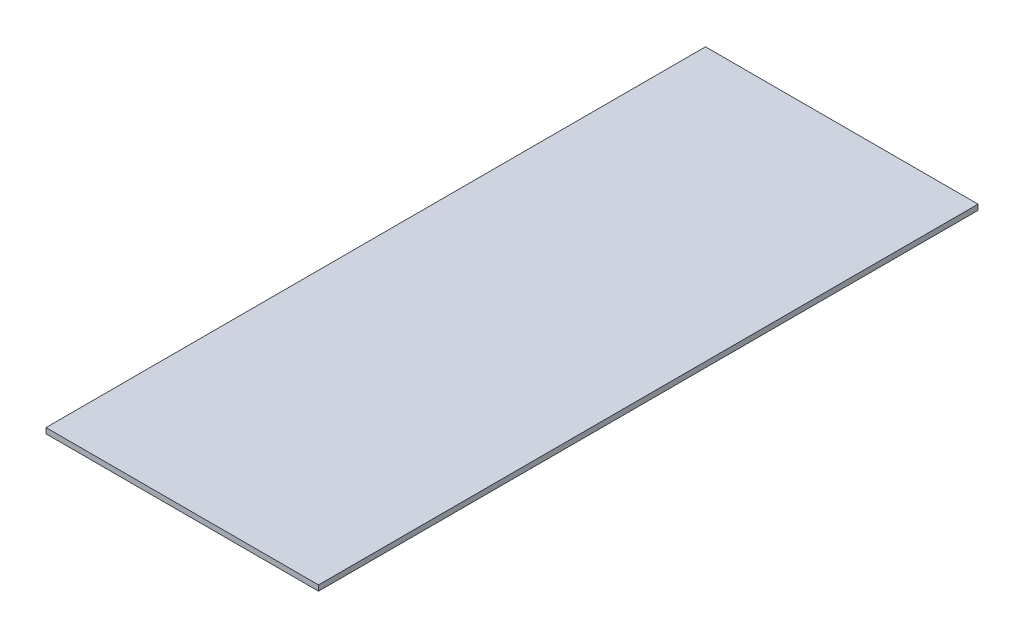
ISO-10303-21;
HEADER;
FILE_DESCRIPTION(('STEP AP214'),'2;1');
FILE_NAME('part.step','',(''),(''),'','','');
FILE_SCHEMA(('AUTOMOTIVE_DESIGN { 1 0 10303 214 1 1 1 1 }'));
ENDSEC;
DATA;
#1=APPLICATION_CONTEXT('core data for automotive mechanical design processes');
#2=APPLICATION_PROTOCOL_DEFINITION('international standard','automotive_design',2000,#1);
#3=PRODUCT_CONTEXT('',#1,'mechanical');
#4=PRODUCT('Part','Part','',(#3));
#5=PRODUCT_RELATED_PRODUCT_CATEGORY('part','',(#4));
#6=PRODUCT_DEFINITION_FORMATION('','',#4);
#7=PRODUCT_DEFINITION_CONTEXT('part definition',#1,'design');
#8=PRODUCT_DEFINITION('design','',#6,#7);
#9=PRODUCT_DEFINITION_SHAPE('','',#8);
#10=(LENGTH_UNIT() NAMED_UNIT(*) SI_UNIT(.MILLI.,.METRE.));
#11=(NAMED_UNIT(*) PLANE_ANGLE_UNIT() SI_UNIT($,.RADIAN.));
#12=(NAMED_UNIT(*) SI_UNIT($,.STERADIAN.) SOLID_ANGLE_UNIT());
#13=UNCERTAINTY_MEASURE_WITH_UNIT(LENGTH_MEASURE(1.E-05),#10,'distance_accuracy_value','');
#14=(GEOMETRIC_REPRESENTATION_CONTEXT(3) GLOBAL_UNCERTAINTY_ASSIGNED_CONTEXT((#13)) GLOBAL_UNIT_ASSIGNED_CONTEXT((#10,
#11,#12)) REPRESENTATION_CONTEXT('',''));
#15=CARTESIAN_POINT('',(0.,0.,0.));
#16=DIRECTION('',(0.,0.,1.));
#17=DIRECTION('',(1.,0.,0.));
#18=AXIS2_PLACEMENT_3D('',#15,#16,#17);
#19=CARTESIAN_POINT('',(-50.,2.,121.));
#20=DIRECTION('',(1.,0.,0.));
#21=DIRECTION('',(0.,0.,-1.));
#22=AXIS2_PLACEMENT_3D('',#19,#20,#21);
#23=PLANE('',#22);
#24=DIRECTION('',(0.,0.,1.));
#25=VECTOR('',#24,1.);
#26=CARTESIAN_POINT('',(-50.,0.,121.));
#27=LINE('',#26,#25);
#28=CARTESIAN_POINT('',(-50.,0.,-121.));
#29=VERTEX_POINT('',#28);
#30=CARTESIAN_POINT('',(-50.,0.,121.));
#31=VERTEX_POINT('',#30);
#32=EDGE_CURVE('E92',#29,#31,#27,.T.);
#33=ORIENTED_EDGE('',*,*,#32,.T.);
#34=DIRECTION('',(0.,-1.,0.));
#35=VECTOR('',#34,1.);
#36=CARTESIAN_POINT('',(-50.,2.,121.));
#37=LINE('',#36,#35);
#38=CARTESIAN_POINT('',(-50.,2.,121.));
#39=VERTEX_POINT('',#38);
#40=EDGE_CURVE('E46',#39,#31,#37,.T.);
#41=ORIENTED_EDGE('',*,*,#40,.F.);
#42=DIRECTION('',(0.,0.,1.));
#43=VECTOR('',#42,1.);
#44=CARTESIAN_POINT('',(-50.,2.,121.));
#45=LINE('',#44,#43);
#46=CARTESIAN_POINT('',(-50.,2.,-121.));
#47=VERTEX_POINT('',#46);
#48=EDGE_CURVE('E85',#47,#39,#45,.T.);
#49=ORIENTED_EDGE('',*,*,#48,.F.);
#50=DIRECTION('',(0.,-1.,0.));
#51=VECTOR('',#50,1.);
#52=CARTESIAN_POINT('',(-50.,2.,-121.));
#53=LINE('',#52,#51);
#54=EDGE_CURVE('E11',#47,#29,#53,.T.);
#55=ORIENTED_EDGE('',*,*,#54,.T.);
#56=EDGE_LOOP('',(#33,#41,#49,#55));
#57=FACE_BOUND('',#56,.T.);
#58=ADVANCED_FACE('F38',(#57),#23,.F.);
#59=CARTESIAN_POINT('',(50.,2.,121.));
#60=DIRECTION('',(0.,0.,-1.));
#61=DIRECTION('',(-1.,0.,0.));
#62=AXIS2_PLACEMENT_3D('',#59,#60,#61);
#63=PLANE('',#62);
#64=DIRECTION('',(1.,0.,0.));
#65=VECTOR('',#64,1.);
#66=CARTESIAN_POINT('',(50.,0.,121.));
#67=LINE('',#66,#65);
#68=CARTESIAN_POINT('',(50.,0.,121.));
#69=VERTEX_POINT('',#68);
#70=EDGE_CURVE('E72',#31,#69,#67,.T.);
#71=ORIENTED_EDGE('',*,*,#70,.T.);
#72=DIRECTION('',(0.,-1.,0.));
#73=VECTOR('',#72,1.);
#74=CARTESIAN_POINT('',(50.,2.,121.));
#75=LINE('',#74,#73);
#76=CARTESIAN_POINT('',(50.,2.,121.));
#77=VERTEX_POINT('',#76);
#78=EDGE_CURVE('E93',#77,#69,#75,.T.);
#79=ORIENTED_EDGE('',*,*,#78,.F.);
#80=DIRECTION('',(1.,0.,0.));
#81=VECTOR('',#80,1.);
#82=CARTESIAN_POINT('',(50.,2.,121.));
#83=LINE('',#82,#81);
#84=EDGE_CURVE('E89',#39,#77,#83,.T.);
#85=ORIENTED_EDGE('',*,*,#84,.F.);
#86=ORIENTED_EDGE('',*,*,#40,.T.);
#87=EDGE_LOOP('',(#71,#79,#85,#86));
#88=FACE_BOUND('',#87,.T.);
#89=ADVANCED_FACE('F94',(#88),#63,.F.);
#90=CARTESIAN_POINT('',(50.,2.,-121.));
#91=DIRECTION('',(-1.,0.,0.));
#92=DIRECTION('',(0.,0.,1.));
#93=AXIS2_PLACEMENT_3D('',#90,#91,#92);
#94=PLANE('',#93);
#95=DIRECTION('',(0.,0.,-1.));
#96=VECTOR('',#95,1.);
#97=CARTESIAN_POINT('',(50.,0.,-121.));
#98=LINE('',#97,#96);
#99=CARTESIAN_POINT('',(50.,0.,-121.));
#100=VERTEX_POINT('',#99);
#101=EDGE_CURVE('E79',#69,#100,#98,.T.);
#102=ORIENTED_EDGE('',*,*,#101,.T.);
#103=DIRECTION('',(0.,-1.,0.));
#104=VECTOR('',#103,1.);
#105=CARTESIAN_POINT('',(50.,2.,-121.));
#106=LINE('',#105,#104);
#107=CARTESIAN_POINT('',(50.,2.,-121.));
#108=VERTEX_POINT('',#107);
#109=EDGE_CURVE('E98',#108,#100,#106,.T.);
#110=ORIENTED_EDGE('',*,*,#109,.F.);
#111=DIRECTION('',(0.,0.,-1.));
#112=VECTOR('',#111,1.);
#113=CARTESIAN_POINT('',(50.,2.,-121.));
#114=LINE('',#113,#112);
#115=EDGE_CURVE('E96',#77,#108,#114,.T.);
#116=ORIENTED_EDGE('',*,*,#115,.F.);
#117=ORIENTED_EDGE('',*,*,#78,.T.);
#118=EDGE_LOOP('',(#102,#110,#116,#117));
#119=FACE_BOUND('',#118,.T.);
#120=ADVANCED_FACE('F108',(#119),#94,.F.);
#121=CARTESIAN_POINT('',(0.,2.,-121.));
#122=DIRECTION('',(0.,0.,1.));
#123=DIRECTION('',(1.,0.,0.));
#124=AXIS2_PLACEMENT_3D('',#121,#122,#123);
#125=PLANE('',#124);
#126=DIRECTION('',(-1.,0.,0.));
#127=VECTOR('',#126,1.);
#128=CARTESIAN_POINT('',(0.,0.,-121.));
#129=LINE('',#128,#127);
#130=EDGE_CURVE('E105',#100,#29,#129,.T.);
#131=ORIENTED_EDGE('',*,*,#130,.T.);
#132=ORIENTED_EDGE('',*,*,#54,.F.);
#133=DIRECTION('',(-1.,0.,0.));
#134=VECTOR('',#133,1.);
#135=CARTESIAN_POINT('',(-50.,2.,-121.));
#136=LINE('',#135,#134);
#137=EDGE_CURVE('E54',#108,#47,#136,.T.);
#138=ORIENTED_EDGE('',*,*,#137,.F.);
#139=ORIENTED_EDGE('',*,*,#109,.T.);
#140=EDGE_LOOP('',(#131,#132,#138,#139));
#141=FACE_BOUND('',#140,.T.);
#142=ADVANCED_FACE('F112',(#141),#125,.F.);
#143=CARTESIAN_POINT('',(0.,2.,0.));
#144=DIRECTION('',(0.,-1.,0.));
#145=DIRECTION('',(0.,0.,-1.));
#146=AXIS2_PLACEMENT_3D('',#143,#144,#145);
#147=PLANE('',#146);
#148=ORIENTED_EDGE('',*,*,#137,.T.);
#149=ORIENTED_EDGE('',*,*,#48,.T.);
#150=ORIENTED_EDGE('',*,*,#84,.T.);
#151=ORIENTED_EDGE('',*,*,#115,.T.);
#152=EDGE_LOOP('',(#148,#149,#150,#151));
#153=FACE_BOUND('',#152,.T.);
#154=ADVANCED_FACE('F87',(#153),#147,.F.);
#155=CARTESIAN_POINT('',(0.,0.,0.));
#156=DIRECTION('',(0.,-1.,0.));
#157=DIRECTION('',(0.,0.,-1.));
#158=AXIS2_PLACEMENT_3D('',#155,#156,#157);
#159=PLANE('',#158);
#160=ORIENTED_EDGE('',*,*,#32,.F.);
#161=ORIENTED_EDGE('',*,*,#130,.F.);
#162=ORIENTED_EDGE('',*,*,#101,.F.);
#163=ORIENTED_EDGE('',*,*,#70,.F.);
#164=EDGE_LOOP('',(#160,#161,#162,#163));
#165=FACE_BOUND('',#164,.T.);
#166=ADVANCED_FACE('F111',(#165),#159,.T.);
#167=CLOSED_SHELL('',(#58,#89,#120,#142,#154,#166));
#168=MANIFOLD_SOLID_BREP('B2',#167);
#169=ADVANCED_BREP_SHAPE_REPRESENTATION('',(#18,#168),#14);
#170=SHAPE_DEFINITION_REPRESENTATION(#9,#169);
ENDSEC;
END-ISO-10303-21;
